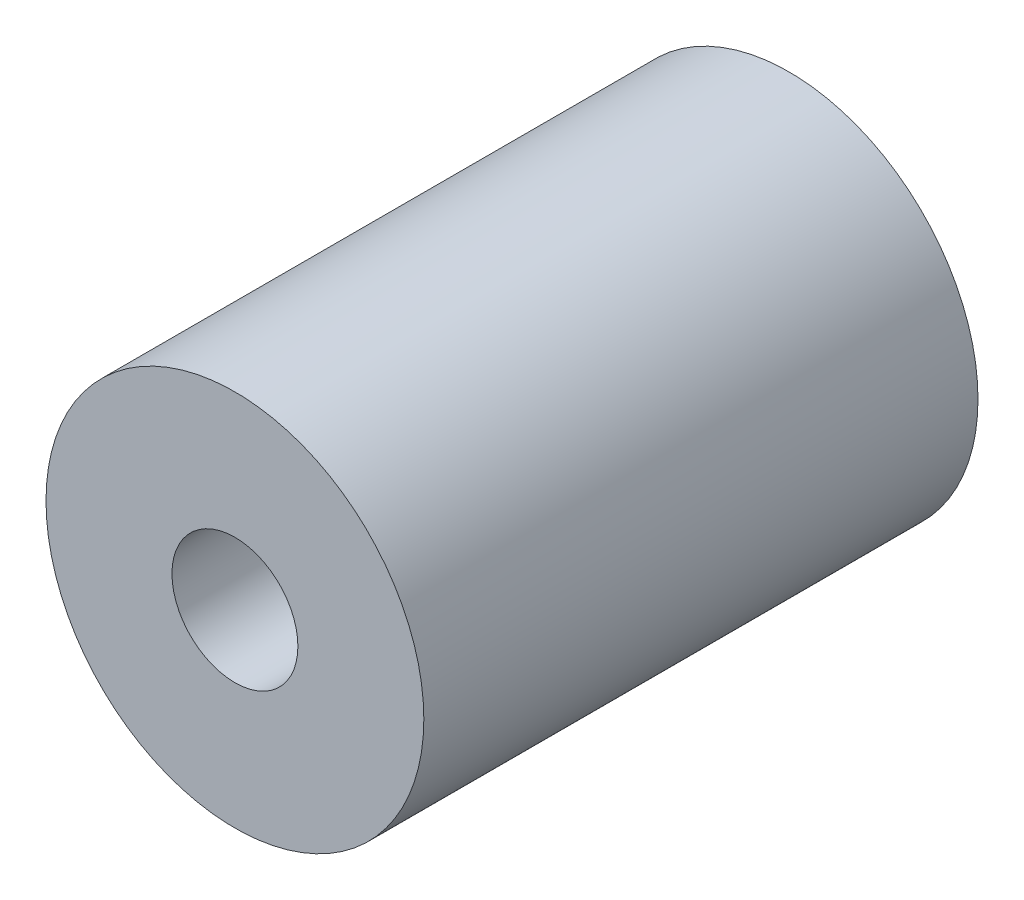
ISO-10303-21;
HEADER;
FILE_DESCRIPTION(('STEP AP214'),'2;1');
FILE_NAME('part.step','',(''),(''),'','','');
FILE_SCHEMA(('AUTOMOTIVE_DESIGN { 1 0 10303 214 1 1 1 1 }'));
ENDSEC;
DATA;
#1=APPLICATION_CONTEXT('core data for automotive mechanical design processes');
#2=APPLICATION_PROTOCOL_DEFINITION('international standard','automotive_design',2000,#1);
#3=PRODUCT_CONTEXT('',#1,'mechanical');
#4=PRODUCT('Part','Part','',(#3));
#5=PRODUCT_RELATED_PRODUCT_CATEGORY('part','',(#4));
#6=PRODUCT_DEFINITION_FORMATION('','',#4);
#7=PRODUCT_DEFINITION_CONTEXT('part definition',#1,'design');
#8=PRODUCT_DEFINITION('design','',#6,#7);
#9=PRODUCT_DEFINITION_SHAPE('','',#8);
#10=(LENGTH_UNIT() NAMED_UNIT(*) SI_UNIT(.MILLI.,.METRE.));
#11=(NAMED_UNIT(*) PLANE_ANGLE_UNIT() SI_UNIT($,.RADIAN.));
#12=(NAMED_UNIT(*) SI_UNIT($,.STERADIAN.) SOLID_ANGLE_UNIT());
#13=UNCERTAINTY_MEASURE_WITH_UNIT(LENGTH_MEASURE(1.E-05),#10,'distance_accuracy_value','');
#14=(GEOMETRIC_REPRESENTATION_CONTEXT(3) GLOBAL_UNCERTAINTY_ASSIGNED_CONTEXT((#13)) GLOBAL_UNIT_ASSIGNED_CONTEXT((#10,
#11,#12)) REPRESENTATION_CONTEXT('',''));
#15=CARTESIAN_POINT('',(0.,0.,0.));
#16=DIRECTION('',(0.,0.,1.));
#17=DIRECTION('',(1.,0.,0.));
#18=AXIS2_PLACEMENT_3D('',#15,#16,#17);
#19=CARTESIAN_POINT('',(0.,0.,27.94));
#20=DIRECTION('',(0.,0.,-1.));
#21=DIRECTION('',(-1.,0.,0.));
#22=AXIS2_PLACEMENT_3D('',#19,#20,#21);
#23=CYLINDRICAL_SURFACE('',#22,3.175);
#24=CARTESIAN_POINT('',(0.,0.,27.94));
#25=DIRECTION('',(0.,0.,1.));
#26=DIRECTION('',(1.,0.,0.));
#27=AXIS2_PLACEMENT_3D('',#24,#25,#26);
#28=CIRCLE('',#27,3.175);
#29=CARTESIAN_POINT('',(3.175,0.,27.94));
#30=VERTEX_POINT('',#29);
#31=EDGE_CURVE('E56',#30,#30,#28,.T.);
#32=ORIENTED_EDGE('',*,*,#31,.T.);
#33=EDGE_LOOP('',(#32));
#34=FACE_BOUND('',#33,.T.);
#35=CARTESIAN_POINT('',(0.,0.,6.5024));
#36=DIRECTION('',(0.,0.,-1.));
#37=DIRECTION('',(-1.,0.,0.));
#38=AXIS2_PLACEMENT_3D('',#35,#36,#37);
#39=CIRCLE('',#38,3.175);
#40=CARTESIAN_POINT('',(-3.175,0.,6.5024));
#41=VERTEX_POINT('',#40);
#42=EDGE_CURVE('E64',#41,#41,#39,.F.);
#43=ORIENTED_EDGE('',*,*,#42,.F.);
#44=EDGE_LOOP('',(#43));
#45=FACE_BOUND('',#44,.T.);
#46=ADVANCED_FACE('F45',(#34,#45),#23,.F.);
#47=CARTESIAN_POINT('',(0.,0.,27.94));
#48=DIRECTION('',(0.,0.,1.));
#49=DIRECTION('',(1.,0.,0.));
#50=AXIS2_PLACEMENT_3D('',#47,#48,#49);
#51=PLANE('',#50);
#52=CARTESIAN_POINT('',(0.,0.,27.94));
#53=DIRECTION('',(0.,0.,1.));
#54=DIRECTION('',(1.,0.,0.));
#55=AXIS2_PLACEMENT_3D('',#52,#53,#54);
#56=CIRCLE('',#55,9.525);
#57=CARTESIAN_POINT('',(9.525,0.,27.94));
#58=VERTEX_POINT('',#57);
#59=EDGE_CURVE('E12',#58,#58,#56,.T.);
#60=ORIENTED_EDGE('',*,*,#59,.T.);
#61=EDGE_LOOP('',(#60));
#62=FACE_BOUND('',#61,.T.);
#63=ORIENTED_EDGE('',*,*,#31,.F.);
#64=EDGE_LOOP('',(#63));
#65=FACE_BOUND('',#64,.T.);
#66=ADVANCED_FACE('F74',(#62,#65),#51,.T.);
#67=CARTESIAN_POINT('',(0.,0.,0.));
#68=DIRECTION('',(0.,0.,1.));
#69=DIRECTION('',(1.,0.,0.));
#70=AXIS2_PLACEMENT_3D('',#67,#68,#69);
#71=PLANE('',#70);
#72=CARTESIAN_POINT('',(0.,0.,0.));
#73=DIRECTION('',(0.,0.,-1.));
#74=DIRECTION('',(-1.,0.,0.));
#75=AXIS2_PLACEMENT_3D('',#72,#73,#74);
#76=CIRCLE('',#75,4.7625);
#77=CARTESIAN_POINT('',(-4.7625,0.,0.));
#78=VERTEX_POINT('',#77);
#79=EDGE_CURVE('E61',#78,#78,#76,.T.);
#80=ORIENTED_EDGE('',*,*,#79,.F.);
#81=EDGE_LOOP('',(#80));
#82=FACE_BOUND('',#81,.T.);
#83=CARTESIAN_POINT('',(0.,0.,0.));
#84=DIRECTION('',(0.,0.,1.));
#85=DIRECTION('',(1.,0.,0.));
#86=AXIS2_PLACEMENT_3D('',#83,#84,#85);
#87=CIRCLE('',#86,9.525);
#88=CARTESIAN_POINT('',(9.525,0.,0.));
#89=VERTEX_POINT('',#88);
#90=EDGE_CURVE('E49',#89,#89,#87,.T.);
#91=ORIENTED_EDGE('',*,*,#90,.F.);
#92=EDGE_LOOP('',(#91));
#93=FACE_BOUND('',#92,.T.);
#94=ADVANCED_FACE('F80',(#82,#93),#71,.F.);
#95=CARTESIAN_POINT('',(0.,0.,27.94));
#96=DIRECTION('',(0.,0.,-1.));
#97=DIRECTION('',(-1.,0.,0.));
#98=AXIS2_PLACEMENT_3D('',#95,#96,#97);
#99=CYLINDRICAL_SURFACE('',#98,9.525);
#100=ORIENTED_EDGE('',*,*,#59,.F.);
#101=EDGE_LOOP('',(#100));
#102=FACE_BOUND('',#101,.T.);
#103=ORIENTED_EDGE('',*,*,#90,.T.);
#104=EDGE_LOOP('',(#103));
#105=FACE_BOUND('',#104,.T.);
#106=ADVANCED_FACE('F47',(#102,#105),#99,.T.);
#107=CARTESIAN_POINT('',(0.,0.,6.5024));
#108=DIRECTION('',(0.,0.,-1.));
#109=DIRECTION('',(-1.,0.,0.));
#110=AXIS2_PLACEMENT_3D('',#107,#108,#109);
#111=CYLINDRICAL_SURFACE('',#110,4.7625);
#112=CARTESIAN_POINT('',(0.,0.,6.5024));
#113=DIRECTION('',(0.,0.,-1.));
#114=DIRECTION('',(-1.,0.,0.));
#115=AXIS2_PLACEMENT_3D('',#112,#113,#114);
#116=CIRCLE('',#115,4.7625);
#117=CARTESIAN_POINT('',(-4.7625,0.,6.5024));
#118=VERTEX_POINT('',#117);
#119=EDGE_CURVE('E60',#118,#118,#116,.T.);
#120=ORIENTED_EDGE('',*,*,#119,.F.);
#121=EDGE_LOOP('',(#120));
#122=FACE_BOUND('',#121,.T.);
#123=ORIENTED_EDGE('',*,*,#79,.T.);
#124=EDGE_LOOP('',(#123));
#125=FACE_BOUND('',#124,.T.);
#126=ADVANCED_FACE('F83',(#122,#125),#111,.F.);
#127=CARTESIAN_POINT('',(0.,0.,6.5024));
#128=DIRECTION('',(0.,0.,-1.));
#129=DIRECTION('',(-1.,0.,0.));
#130=AXIS2_PLACEMENT_3D('',#127,#128,#129);
#131=PLANE('',#130);
#132=ORIENTED_EDGE('',*,*,#42,.T.);
#133=EDGE_LOOP('',(#132));
#134=FACE_BOUND('',#133,.T.);
#135=ORIENTED_EDGE('',*,*,#119,.T.);
#136=EDGE_LOOP('',(#135));
#137=FACE_BOUND('',#136,.T.);
#138=ADVANCED_FACE('F70',(#134,#137),#131,.T.);
#139=CLOSED_SHELL('',(#46,#66,#94,#106,#126,#138));
#140=MANIFOLD_SOLID_BREP('B2',#139);
#141=ADVANCED_BREP_SHAPE_REPRESENTATION('',(#18,#140),#14);
#142=SHAPE_DEFINITION_REPRESENTATION(#9,#141);
ENDSEC;
END-ISO-10303-21;
